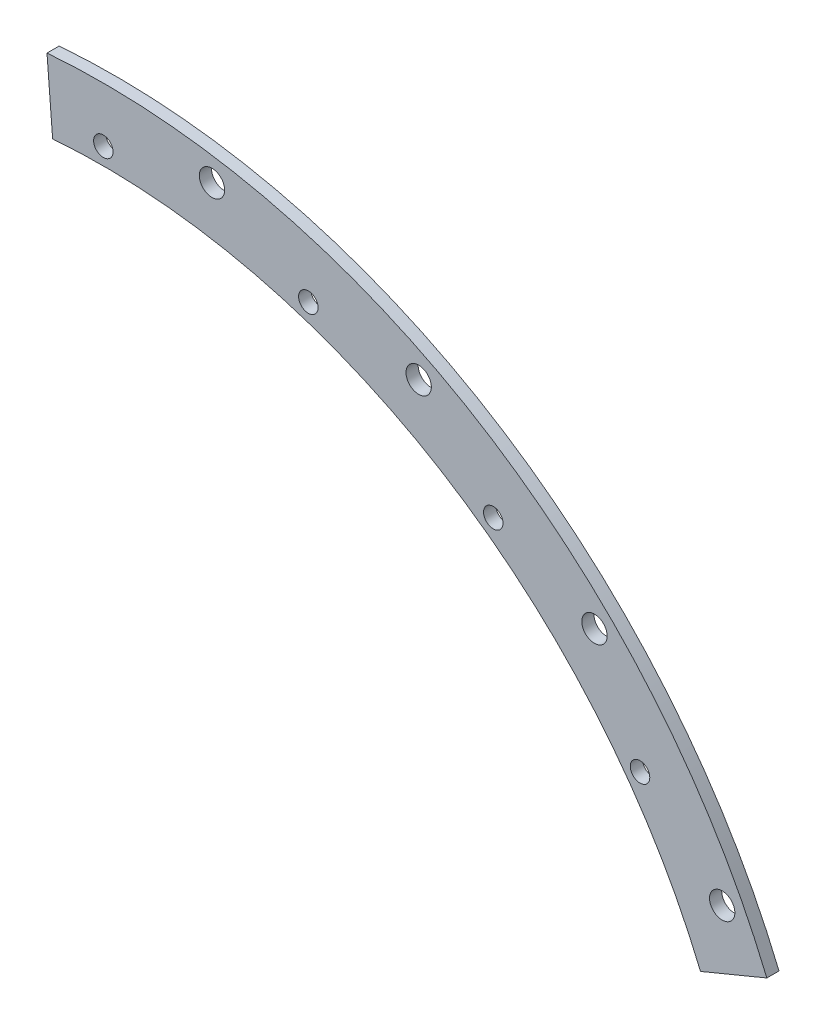
ISO-10303-21;
HEADER;
FILE_DESCRIPTION(('STEP AP214'),'2;1');
FILE_NAME('part.step','',(''),(''),'','','');
FILE_SCHEMA(('AUTOMOTIVE_DESIGN { 1 0 10303 214 1 1 1 1 }'));
ENDSEC;
DATA;
#1=APPLICATION_CONTEXT('core data for automotive mechanical design processes');
#2=APPLICATION_PROTOCOL_DEFINITION('international standard','automotive_design',2000,#1);
#3=PRODUCT_CONTEXT('',#1,'mechanical');
#4=PRODUCT('Part','Part','',(#3));
#5=PRODUCT_RELATED_PRODUCT_CATEGORY('part','',(#4));
#6=PRODUCT_DEFINITION_FORMATION('','',#4);
#7=PRODUCT_DEFINITION_CONTEXT('part definition',#1,'design');
#8=PRODUCT_DEFINITION('design','',#6,#7);
#9=PRODUCT_DEFINITION_SHAPE('','',#8);
#10=(LENGTH_UNIT() NAMED_UNIT(*) SI_UNIT(.MILLI.,.METRE.));
#11=(NAMED_UNIT(*) PLANE_ANGLE_UNIT() SI_UNIT($,.RADIAN.));
#12=(NAMED_UNIT(*) SI_UNIT($,.STERADIAN.) SOLID_ANGLE_UNIT());
#13=UNCERTAINTY_MEASURE_WITH_UNIT(LENGTH_MEASURE(1.E-05),#10,'distance_accuracy_value','');
#14=(GEOMETRIC_REPRESENTATION_CONTEXT(3) GLOBAL_UNCERTAINTY_ASSIGNED_CONTEXT((#13)) GLOBAL_UNIT_ASSIGNED_CONTEXT((#10,
#11,#12)) REPRESENTATION_CONTEXT('',''));
#15=CARTESIAN_POINT('',(0.,0.,0.));
#16=DIRECTION('',(0.,0.,1.));
#17=DIRECTION('',(1.,0.,0.));
#18=AXIS2_PLACEMENT_3D('',#15,#16,#17);
#19=CARTESIAN_POINT('',(0.,0.,28.575));
#20=DIRECTION('',(0.,0.,-1.));
#21=DIRECTION('',(-1.,0.,0.));
#22=AXIS2_PLACEMENT_3D('',#19,#20,#21);
#23=PLANE('',#22);
#24=CARTESIAN_POINT('',(0.,0.,28.575));
#25=DIRECTION('',(0.,0.,-1.));
#26=DIRECTION('',(-1.,0.,0.));
#27=AXIS2_PLACEMENT_3D('',#24,#25,#26);
#28=CIRCLE('',#27,168.656);
#29=CARTESIAN_POINT('',(-13.2325972490754,168.136089838094,28.575));
#30=VERTEX_POINT('',#29);
#31=CARTESIAN_POINT('',(155.817826435224,64.541856968966,28.575));
#32=VERTEX_POINT('',#31);
#33=EDGE_CURVE('E78',#30,#32,#28,.T.);
#34=ORIENTED_EDGE('',*,*,#33,.F.);
#35=DIRECTION('',(0.0784590957278451,-0.996917333733128,0.));
#36=VECTOR('',#35,1.);
#37=CARTESIAN_POINT('',(0.,0.,28.575));
#38=LINE('',#37,#36);
#39=CARTESIAN_POINT('',(-14.7023322597973,186.81084379225,28.575));
#40=VERTEX_POINT('',#39);
#41=EDGE_CURVE('E83',#40,#30,#38,.T.);
#42=ORIENTED_EDGE('',*,*,#41,.F.);
#43=CARTESIAN_POINT('',(0.,0.,28.575));
#44=DIRECTION('',(0.,0.,1.));
#45=DIRECTION('',(1.,0.,0.));
#46=AXIS2_PLACEMENT_3D('',#43,#44,#45);
#47=CIRCLE('',#46,187.3885);
#48=CARTESIAN_POINT('',(173.124399777992,71.710474365745,28.575));
#49=VERTEX_POINT('',#48);
#50=EDGE_CURVE('E80',#49,#40,#47,.T.);
#51=ORIENTED_EDGE('',*,*,#50,.F.);
#52=DIRECTION('',(0.923879532511288,0.382683432365086,0.));
#53=VECTOR('',#52,1.);
#54=CARTESIAN_POINT('',(0.,0.,28.575));
#55=LINE('',#54,#53);
#56=EDGE_CURVE('E74',#32,#49,#55,.T.);
#57=ORIENTED_EDGE('',*,*,#56,.F.);
#58=EDGE_LOOP('',(#34,#42,#51,#57));
#59=FACE_BOUND('',#58,.T.);
#60=CARTESIAN_POINT('',(53.4911507432979,164.628834027207,28.575));
#61=DIRECTION('',(0.,0.,1.));
#62=DIRECTION('',(1.,0.,0.));
#63=AXIS2_PLACEMENT_3D('',#60,#61,#62);
#64=CIRCLE('',#63,2.54);
#65=CARTESIAN_POINT('',(56.0311507432979,164.628834027207,28.575));
#66=VERTEX_POINT('',#65);
#67=EDGE_CURVE('E100',#66,#66,#64,.T.);
#68=ORIENTED_EDGE('',*,*,#67,.T.);
#69=EDGE_LOOP('',(#68));
#70=FACE_BOUND('',#69,.T.);
#71=CARTESIAN_POINT('',(140.041650743303,101.746214957089,28.575));
#72=DIRECTION('',(0.,0.,1.));
#73=DIRECTION('',(1.,0.,0.));
#74=AXIS2_PLACEMENT_3D('',#71,#72,#73);
#75=CIRCLE('',#74,2.54000000000234);
#76=CARTESIAN_POINT('',(142.581650743305,101.746214957089,28.575));
#77=VERTEX_POINT('',#76);
#78=EDGE_CURVE('E106',#77,#77,#75,.T.);
#79=ORIENTED_EDGE('',*,*,#78,.T.);
#80=EDGE_LOOP('',(#79));
#81=FACE_BOUND('',#80,.T.);
#82=CARTESIAN_POINT('',(101.746214957082,140.041650743305,28.575));
#83=DIRECTION('',(0.,0.,1.));
#84=DIRECTION('',(1.,0.,0.));
#85=AXIS2_PLACEMENT_3D('',#82,#83,#84);
#86=CIRCLE('',#85,2.54000000000038);
#87=CARTESIAN_POINT('',(104.286214957082,140.041650743305,28.575));
#88=VERTEX_POINT('',#87);
#89=EDGE_CURVE('E103',#88,#88,#86,.T.);
#90=ORIENTED_EDGE('',*,*,#89,.T.);
#91=EDGE_LOOP('',(#90));
#92=FACE_BOUND('',#91,.T.);
#93=CARTESIAN_POINT('',(0.,173.101,28.575));
#94=DIRECTION('',(0.,0.,1.));
#95=DIRECTION('',(1.,0.,0.));
#96=AXIS2_PLACEMENT_3D('',#93,#94,#95);
#97=CIRCLE('',#96,2.54);
#98=CARTESIAN_POINT('',(2.54,173.101,28.575));
#99=VERTEX_POINT('',#98);
#100=EDGE_CURVE('E92',#99,#99,#97,.T.);
#101=ORIENTED_EDGE('',*,*,#100,.T.);
#102=EDGE_LOOP('',(#101));
#103=FACE_BOUND('',#102,.T.);
#104=CARTESIAN_POINT('',(28.3504616647761,178.997770277716,28.575));
#105=DIRECTION('',(0.,0.,1.));
#106=DIRECTION('',(1.,0.,0.));
#107=AXIS2_PLACEMENT_3D('',#104,#105,#106);
#108=CIRCLE('',#107,3.30199999999999);
#109=CARTESIAN_POINT('',(31.6524616647761,178.997770277716,28.575));
#110=VERTEX_POINT('',#109);
#111=EDGE_CURVE('E121',#110,#110,#108,.T.);
#112=ORIENTED_EDGE('',*,*,#111,.T.);
#113=EDGE_LOOP('',(#112));
#114=FACE_BOUND('',#113,.T.);
#115=CARTESIAN_POINT('',(161.476221372138,82.2762442773039,28.575));
#116=DIRECTION('',(0.,0.,1.));
#117=DIRECTION('',(1.,0.,0.));
#118=AXIS2_PLACEMENT_3D('',#115,#116,#117);
#119=CIRCLE('',#118,3.30200000000161);
#120=CARTESIAN_POINT('',(164.778221372139,82.2762442773039,28.575));
#121=VERTEX_POINT('',#120);
#122=EDGE_CURVE('E118',#121,#121,#119,.T.);
#123=ORIENTED_EDGE('',*,*,#122,.T.);
#124=EDGE_LOOP('',(#123));
#125=FACE_BOUND('',#124,.T.);
#126=CARTESIAN_POINT('',(128.148254847659,128.148254847661,28.575));
#127=DIRECTION('',(0.,0.,1.));
#128=DIRECTION('',(1.,0.,0.));
#129=AXIS2_PLACEMENT_3D('',#126,#127,#128);
#130=CIRCLE('',#129,3.30200000000034);
#131=CARTESIAN_POINT('',(131.450254847659,128.148254847661,28.575));
#132=VERTEX_POINT('',#131);
#133=EDGE_CURVE('E115',#132,#132,#130,.T.);
#134=ORIENTED_EDGE('',*,*,#133,.T.);
#135=EDGE_LOOP('',(#134));
#136=FACE_BOUND('',#135,.T.);
#137=CARTESIAN_POINT('',(82.2762442772985,161.476221372134,28.575));
#138=DIRECTION('',(0.,0.,1.));
#139=DIRECTION('',(1.,0.,0.));
#140=AXIS2_PLACEMENT_3D('',#137,#138,#139);
#141=CIRCLE('',#140,3.302);
#142=CARTESIAN_POINT('',(85.5782442772985,161.476221372134,28.575));
#143=VERTEX_POINT('',#142);
#144=EDGE_CURVE('E111',#143,#143,#141,.T.);
#145=ORIENTED_EDGE('',*,*,#144,.T.);
#146=EDGE_LOOP('',(#145));
#147=FACE_BOUND('',#146,.T.);
#148=ADVANCED_FACE('F32',(#59,#70,#81,#92,#103,#114,#125,#136,#147),#23,.T.);
#149=CARTESIAN_POINT('',(0.,0.,3.175));
#150=DIRECTION('',(0.,0.,-1.));
#151=DIRECTION('',(-1.,0.,0.));
#152=AXIS2_PLACEMENT_3D('',#149,#150,#151);
#153=CYLINDRICAL_SURFACE('',#152,168.656);
#154=DIRECTION('',(0.,0.,-1.));
#155=VECTOR('',#154,1.);
#156=CARTESIAN_POINT('',(-13.2325972490754,168.136089838094,3.175));
#157=LINE('',#156,#155);
#158=CARTESIAN_POINT('',(-13.2325972490755,168.136089838095,31.75));
#159=VERTEX_POINT('',#158);
#160=EDGE_CURVE('E36',#159,#30,#157,.T.);
#161=ORIENTED_EDGE('',*,*,#160,.T.);
#162=ORIENTED_EDGE('',*,*,#33,.T.);
#163=DIRECTION('',(0.,0.,-1.));
#164=VECTOR('',#163,1.);
#165=CARTESIAN_POINT('',(155.817826435224,64.541856968966,3.175));
#166=LINE('',#165,#164);
#167=CARTESIAN_POINT('',(155.817826435224,64.541856968966,31.75));
#168=VERTEX_POINT('',#167);
#169=EDGE_CURVE('E88',#32,#168,#166,.F.);
#170=ORIENTED_EDGE('',*,*,#169,.T.);
#171=CARTESIAN_POINT('',(0.,0.,31.75));
#172=DIRECTION('',(0.,0.,1.));
#173=DIRECTION('',(1.,0.,0.));
#174=AXIS2_PLACEMENT_3D('',#171,#172,#173);
#175=CIRCLE('',#174,168.656);
#176=EDGE_CURVE('E128',#168,#159,#175,.T.);
#177=ORIENTED_EDGE('',*,*,#176,.T.);
#178=EDGE_LOOP('',(#161,#162,#170,#177));
#179=FACE_BOUND('',#178,.T.);
#180=ADVANCED_FACE('F86',(#179),#153,.F.);
#181=CARTESIAN_POINT('',(0.,0.,-0.0100000000000031));
#182=DIRECTION('',(0.382683432365086,-0.923879532511288,0.));
#183=DIRECTION('',(0.923879532511288,0.382683432365086,0.));
#184=AXIS2_PLACEMENT_3D('',#181,#182,#183);
#185=PLANE('',#184);
#186=ORIENTED_EDGE('',*,*,#169,.F.);
#187=ORIENTED_EDGE('',*,*,#56,.T.);
#188=DIRECTION('',(0.,0.,-1.));
#189=VECTOR('',#188,1.);
#190=CARTESIAN_POINT('',(173.124399777992,71.710474365745,31.75));
#191=LINE('',#190,#189);
#192=CARTESIAN_POINT('',(173.124399777992,71.710474365745,31.75));
#193=VERTEX_POINT('',#192);
#194=EDGE_CURVE('E11',#49,#193,#191,.F.);
#195=ORIENTED_EDGE('',*,*,#194,.T.);
#196=DIRECTION('',(0.923879532511288,0.382683432365086,0.));
#197=VECTOR('',#196,1.);
#198=CARTESIAN_POINT('',(0.,0.,31.75));
#199=LINE('',#198,#197);
#200=EDGE_CURVE('E95',#168,#193,#199,.T.);
#201=ORIENTED_EDGE('',*,*,#200,.F.);
#202=EDGE_LOOP('',(#186,#187,#195,#201));
#203=FACE_BOUND('',#202,.T.);
#204=ADVANCED_FACE('F94',(#203),#185,.T.);
#205=CARTESIAN_POINT('',(0.,0.,31.75));
#206=DIRECTION('',(0.,0.,1.));
#207=DIRECTION('',(1.,0.,0.));
#208=AXIS2_PLACEMENT_3D('',#205,#206,#207);
#209=PLANE('',#208);
#210=CARTESIAN_POINT('',(53.4911507432979,164.628834027207,31.75));
#211=DIRECTION('',(0.,0.,1.));
#212=DIRECTION('',(1.,0.,0.));
#213=AXIS2_PLACEMENT_3D('',#210,#211,#212);
#214=CIRCLE('',#213,2.54);
#215=CARTESIAN_POINT('',(56.0311507432979,164.628834027207,31.75));
#216=VERTEX_POINT('',#215);
#217=EDGE_CURVE('E125',#216,#216,#214,.T.);
#218=ORIENTED_EDGE('',*,*,#217,.F.);
#219=EDGE_LOOP('',(#218));
#220=FACE_BOUND('',#219,.T.);
#221=CARTESIAN_POINT('',(0.,173.101,31.75));
#222=DIRECTION('',(0.,0.,1.));
#223=DIRECTION('',(1.,0.,0.));
#224=AXIS2_PLACEMENT_3D('',#221,#222,#223);
#225=CIRCLE('',#224,2.54);
#226=CARTESIAN_POINT('',(2.54,173.101,31.75));
#227=VERTEX_POINT('',#226);
#228=EDGE_CURVE('E114',#227,#227,#225,.T.);
#229=ORIENTED_EDGE('',*,*,#228,.F.);
#230=EDGE_LOOP('',(#229));
#231=FACE_BOUND('',#230,.T.);
#232=CARTESIAN_POINT('',(140.041650743303,101.746214957089,31.75));
#233=DIRECTION('',(0.,0.,1.));
#234=DIRECTION('',(1.,0.,0.));
#235=AXIS2_PLACEMENT_3D('',#232,#233,#234);
#236=CIRCLE('',#235,2.54000000000234);
#237=CARTESIAN_POINT('',(142.581650743305,101.746214957089,31.75));
#238=VERTEX_POINT('',#237);
#239=EDGE_CURVE('E130',#238,#238,#236,.T.);
#240=ORIENTED_EDGE('',*,*,#239,.F.);
#241=EDGE_LOOP('',(#240));
#242=FACE_BOUND('',#241,.T.);
#243=CARTESIAN_POINT('',(101.746214957082,140.041650743305,31.75));
#244=DIRECTION('',(0.,0.,1.));
#245=DIRECTION('',(1.,0.,0.));
#246=AXIS2_PLACEMENT_3D('',#243,#244,#245);
#247=CIRCLE('',#246,2.54000000000038);
#248=CARTESIAN_POINT('',(104.286214957082,140.041650743305,31.75));
#249=VERTEX_POINT('',#248);
#250=EDGE_CURVE('E129',#249,#249,#247,.T.);
#251=ORIENTED_EDGE('',*,*,#250,.F.);
#252=EDGE_LOOP('',(#251));
#253=FACE_BOUND('',#252,.T.);
#254=CARTESIAN_POINT('',(28.3504616647761,178.997770277716,31.75));
#255=DIRECTION('',(0.,0.,1.));
#256=DIRECTION('',(1.,0.,0.));
#257=AXIS2_PLACEMENT_3D('',#254,#255,#256);
#258=CIRCLE('',#257,3.30199999999999);
#259=CARTESIAN_POINT('',(31.6524616647761,178.997770277716,31.75));
#260=VERTEX_POINT('',#259);
#261=EDGE_CURVE('E124',#260,#260,#258,.T.);
#262=ORIENTED_EDGE('',*,*,#261,.F.);
#263=EDGE_LOOP('',(#262));
#264=FACE_BOUND('',#263,.T.);
#265=CARTESIAN_POINT('',(161.476221372138,82.2762442773039,31.75));
#266=DIRECTION('',(0.,0.,1.));
#267=DIRECTION('',(1.,0.,0.));
#268=AXIS2_PLACEMENT_3D('',#265,#266,#267);
#269=CIRCLE('',#268,3.30200000000161);
#270=CARTESIAN_POINT('',(164.778221372139,82.2762442773039,31.75));
#271=VERTEX_POINT('',#270);
#272=EDGE_CURVE('E91',#271,#271,#269,.T.);
#273=ORIENTED_EDGE('',*,*,#272,.F.);
#274=EDGE_LOOP('',(#273));
#275=FACE_BOUND('',#274,.T.);
#276=CARTESIAN_POINT('',(128.148254847659,128.148254847661,31.75));
#277=DIRECTION('',(0.,0.,1.));
#278=DIRECTION('',(1.,0.,0.));
#279=AXIS2_PLACEMENT_3D('',#276,#277,#278);
#280=CIRCLE('',#279,3.30200000000034);
#281=CARTESIAN_POINT('',(131.450254847659,128.148254847661,31.75));
#282=VERTEX_POINT('',#281);
#283=EDGE_CURVE('E142',#282,#282,#280,.T.);
#284=ORIENTED_EDGE('',*,*,#283,.F.);
#285=EDGE_LOOP('',(#284));
#286=FACE_BOUND('',#285,.T.);
#287=CARTESIAN_POINT('',(82.2762442772985,161.476221372134,31.75));
#288=DIRECTION('',(0.,0.,1.));
#289=DIRECTION('',(1.,0.,0.));
#290=AXIS2_PLACEMENT_3D('',#287,#288,#289);
#291=CIRCLE('',#290,3.302);
#292=CARTESIAN_POINT('',(85.5782442772985,161.476221372134,31.75));
#293=VERTEX_POINT('',#292);
#294=EDGE_CURVE('E139',#293,#293,#291,.T.);
#295=ORIENTED_EDGE('',*,*,#294,.F.);
#296=EDGE_LOOP('',(#295));
#297=FACE_BOUND('',#296,.T.);
#298=CARTESIAN_POINT('',(0.,0.,31.75));
#299=DIRECTION('',(0.,0.,1.));
#300=DIRECTION('',(1.,0.,0.));
#301=AXIS2_PLACEMENT_3D('',#298,#299,#300);
#302=CIRCLE('',#301,187.3885);
#303=CARTESIAN_POINT('',(-14.7023322597973,186.81084379225,31.75));
#304=VERTEX_POINT('',#303);
#305=EDGE_CURVE('E49',#193,#304,#302,.T.);
#306=ORIENTED_EDGE('',*,*,#305,.T.);
#307=DIRECTION('',(0.0784590957278451,-0.996917333733128,0.));
#308=VECTOR('',#307,1.);
#309=CARTESIAN_POINT('',(0.,0.,31.75));
#310=LINE('',#309,#308);
#311=EDGE_CURVE('E97',#304,#159,#310,.T.);
#312=ORIENTED_EDGE('',*,*,#311,.T.);
#313=ORIENTED_EDGE('',*,*,#176,.F.);
#314=ORIENTED_EDGE('',*,*,#200,.T.);
#315=EDGE_LOOP('',(#306,#312,#313,#314));
#316=FACE_BOUND('',#315,.T.);
#317=ADVANCED_FACE('F153',(#220,#231,#242,#253,#264,#275,#286,#297,#316),#209,.T.);
#318=CARTESIAN_POINT('',(82.2762442772985,161.476221372134,0.));
#319=DIRECTION('',(0.,0.,1.));
#320=DIRECTION('',(1.,0.,0.));
#321=AXIS2_PLACEMENT_3D('',#318,#319,#320);
#322=CYLINDRICAL_SURFACE('',#321,3.302);
#323=ORIENTED_EDGE('',*,*,#294,.T.);
#324=EDGE_LOOP('',(#323));
#325=FACE_BOUND('',#324,.T.);
#326=ORIENTED_EDGE('',*,*,#144,.F.);
#327=EDGE_LOOP('',(#326));
#328=FACE_BOUND('',#327,.T.);
#329=ADVANCED_FACE('F34',(#325,#328),#322,.F.);
#330=CARTESIAN_POINT('',(128.148254847659,128.148254847661,0.));
#331=DIRECTION('',(0.,0.,1.));
#332=DIRECTION('',(1.,0.,0.));
#333=AXIS2_PLACEMENT_3D('',#330,#331,#332);
#334=CYLINDRICAL_SURFACE('',#333,3.30200000000034);
#335=ORIENTED_EDGE('',*,*,#283,.T.);
#336=EDGE_LOOP('',(#335));
#337=FACE_BOUND('',#336,.T.);
#338=ORIENTED_EDGE('',*,*,#133,.F.);
#339=EDGE_LOOP('',(#338));
#340=FACE_BOUND('',#339,.T.);
#341=ADVANCED_FACE('F181',(#337,#340),#334,.F.);
#342=CARTESIAN_POINT('',(161.476221372138,82.2762442773039,0.));
#343=DIRECTION('',(0.,0.,1.));
#344=DIRECTION('',(1.,0.,0.));
#345=AXIS2_PLACEMENT_3D('',#342,#343,#344);
#346=CYLINDRICAL_SURFACE('',#345,3.30200000000161);
#347=ORIENTED_EDGE('',*,*,#272,.T.);
#348=EDGE_LOOP('',(#347));
#349=FACE_BOUND('',#348,.T.);
#350=ORIENTED_EDGE('',*,*,#122,.F.);
#351=EDGE_LOOP('',(#350));
#352=FACE_BOUND('',#351,.T.);
#353=ADVANCED_FACE('F178',(#349,#352),#346,.F.);
#354=CARTESIAN_POINT('',(28.3504616647761,178.997770277716,0.));
#355=DIRECTION('',(0.,0.,1.));
#356=DIRECTION('',(1.,0.,0.));
#357=AXIS2_PLACEMENT_3D('',#354,#355,#356);
#358=CYLINDRICAL_SURFACE('',#357,3.30199999999999);
#359=ORIENTED_EDGE('',*,*,#261,.T.);
#360=EDGE_LOOP('',(#359));
#361=FACE_BOUND('',#360,.T.);
#362=ORIENTED_EDGE('',*,*,#111,.F.);
#363=EDGE_LOOP('',(#362));
#364=FACE_BOUND('',#363,.T.);
#365=ADVANCED_FACE('F174',(#361,#364),#358,.F.);
#366=CARTESIAN_POINT('',(101.746214957082,140.041650743305,28.575));
#367=DIRECTION('',(0.,0.,1.));
#368=DIRECTION('',(1.,0.,0.));
#369=AXIS2_PLACEMENT_3D('',#366,#367,#368);
#370=CYLINDRICAL_SURFACE('',#369,2.54000000000038);
#371=ORIENTED_EDGE('',*,*,#89,.F.);
#372=EDGE_LOOP('',(#371));
#373=FACE_BOUND('',#372,.T.);
#374=ORIENTED_EDGE('',*,*,#250,.T.);
#375=EDGE_LOOP('',(#374));
#376=FACE_BOUND('',#375,.T.);
#377=ADVANCED_FACE('F177',(#373,#376),#370,.F.);
#378=CARTESIAN_POINT('',(140.041650743303,101.746214957089,28.575));
#379=DIRECTION('',(0.,0.,1.));
#380=DIRECTION('',(1.,0.,0.));
#381=AXIS2_PLACEMENT_3D('',#378,#379,#380);
#382=CYLINDRICAL_SURFACE('',#381,2.54000000000234);
#383=ORIENTED_EDGE('',*,*,#78,.F.);
#384=EDGE_LOOP('',(#383));
#385=FACE_BOUND('',#384,.T.);
#386=ORIENTED_EDGE('',*,*,#239,.T.);
#387=EDGE_LOOP('',(#386));
#388=FACE_BOUND('',#387,.T.);
#389=ADVANCED_FACE('F209',(#385,#388),#382,.F.);
#390=CARTESIAN_POINT('',(0.,173.101,28.575));
#391=DIRECTION('',(0.,0.,1.));
#392=DIRECTION('',(1.,0.,0.));
#393=AXIS2_PLACEMENT_3D('',#390,#391,#392);
#394=CYLINDRICAL_SURFACE('',#393,2.54);
#395=ORIENTED_EDGE('',*,*,#100,.F.);
#396=EDGE_LOOP('',(#395));
#397=FACE_BOUND('',#396,.T.);
#398=ORIENTED_EDGE('',*,*,#228,.T.);
#399=EDGE_LOOP('',(#398));
#400=FACE_BOUND('',#399,.T.);
#401=ADVANCED_FACE('F206',(#397,#400),#394,.F.);
#402=CARTESIAN_POINT('',(53.4911507432979,164.628834027207,28.575));
#403=DIRECTION('',(0.,0.,1.));
#404=DIRECTION('',(1.,0.,0.));
#405=AXIS2_PLACEMENT_3D('',#402,#403,#404);
#406=CYLINDRICAL_SURFACE('',#405,2.54);
#407=ORIENTED_EDGE('',*,*,#67,.F.);
#408=EDGE_LOOP('',(#407));
#409=FACE_BOUND('',#408,.T.);
#410=ORIENTED_EDGE('',*,*,#217,.T.);
#411=EDGE_LOOP('',(#410));
#412=FACE_BOUND('',#411,.T.);
#413=ADVANCED_FACE('F162',(#409,#412),#406,.F.);
#414=CARTESIAN_POINT('',(0.,0.,-0.0100000000000031));
#415=DIRECTION('',(-0.996917333733128,-0.0784590957278451,0.));
#416=DIRECTION('',(0.0784590957278451,-0.996917333733128,0.));
#417=AXIS2_PLACEMENT_3D('',#414,#415,#416);
#418=PLANE('',#417);
#419=ORIENTED_EDGE('',*,*,#41,.T.);
#420=ORIENTED_EDGE('',*,*,#160,.F.);
#421=ORIENTED_EDGE('',*,*,#311,.F.);
#422=DIRECTION('',(0.,0.,-1.));
#423=VECTOR('',#422,1.);
#424=CARTESIAN_POINT('',(-14.7023322597973,186.81084379225,31.75));
#425=LINE('',#424,#423);
#426=EDGE_CURVE('E41',#304,#40,#425,.T.);
#427=ORIENTED_EDGE('',*,*,#426,.T.);
#428=EDGE_LOOP('',(#419,#420,#421,#427));
#429=FACE_BOUND('',#428,.T.);
#430=ADVANCED_FACE('F155',(#429),#418,.T.);
#431=CARTESIAN_POINT('',(0.,0.,31.75));
#432=DIRECTION('',(0.,0.,-1.));
#433=DIRECTION('',(-1.,0.,0.));
#434=AXIS2_PLACEMENT_3D('',#431,#432,#433);
#435=CYLINDRICAL_SURFACE('',#434,187.3885);
#436=ORIENTED_EDGE('',*,*,#426,.F.);
#437=ORIENTED_EDGE('',*,*,#305,.F.);
#438=ORIENTED_EDGE('',*,*,#194,.F.);
#439=ORIENTED_EDGE('',*,*,#50,.T.);
#440=EDGE_LOOP('',(#436,#437,#438,#439));
#441=FACE_BOUND('',#440,.T.);
#442=ADVANCED_FACE('F156',(#441),#435,.T.);
#443=CLOSED_SHELL('',(#148,#180,#204,#317,#329,#341,#353,#365,#377,#389,#401,#413,#430,#442));
#444=MANIFOLD_SOLID_BREP('B2',#443);
#445=ADVANCED_BREP_SHAPE_REPRESENTATION('',(#18,#444),#14);
#446=SHAPE_DEFINITION_REPRESENTATION(#9,#445);
ENDSEC;
END-ISO-10303-21;
